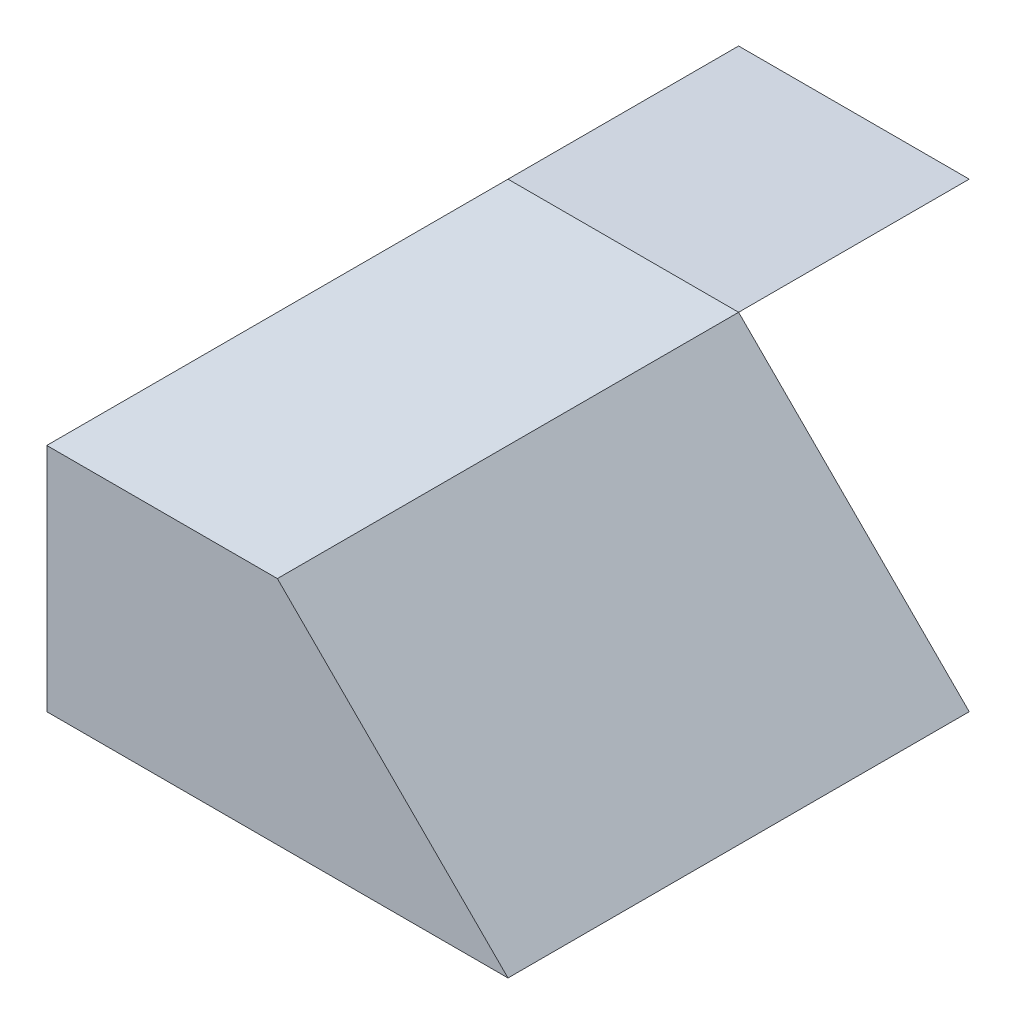
ISO-10303-21;
HEADER;
FILE_DESCRIPTION(('STEP AP214'),'2;1');
FILE_NAME('part.step','',(''),(''),'','','');
FILE_SCHEMA(('AUTOMOTIVE_DESIGN { 1 0 10303 214 1 1 1 1 }'));
ENDSEC;
DATA;
#1=APPLICATION_CONTEXT('core data for automotive mechanical design processes');
#2=APPLICATION_PROTOCOL_DEFINITION('international standard','automotive_design',2000,#1);
#3=PRODUCT_CONTEXT('',#1,'mechanical');
#4=PRODUCT('Part','Part','',(#3));
#5=PRODUCT_RELATED_PRODUCT_CATEGORY('part','',(#4));
#6=PRODUCT_DEFINITION_FORMATION('','',#4);
#7=PRODUCT_DEFINITION_CONTEXT('part definition',#1,'design');
#8=PRODUCT_DEFINITION('design','',#6,#7);
#9=PRODUCT_DEFINITION_SHAPE('','',#8);
#10=(LENGTH_UNIT() NAMED_UNIT(*) SI_UNIT(.MILLI.,.METRE.));
#11=(NAMED_UNIT(*) PLANE_ANGLE_UNIT() SI_UNIT($,.RADIAN.));
#12=(NAMED_UNIT(*) SI_UNIT($,.STERADIAN.) SOLID_ANGLE_UNIT());
#13=UNCERTAINTY_MEASURE_WITH_UNIT(LENGTH_MEASURE(1.E-05),#10,'distance_accuracy_value','');
#14=(GEOMETRIC_REPRESENTATION_CONTEXT(3) GLOBAL_UNCERTAINTY_ASSIGNED_CONTEXT((#13)) GLOBAL_UNIT_ASSIGNED_CONTEXT((#10,
#11,#12)) REPRESENTATION_CONTEXT('',''));
#15=CARTESIAN_POINT('',(0.,0.,0.));
#16=DIRECTION('',(0.,0.,1.));
#17=DIRECTION('',(1.,0.,0.));
#18=AXIS2_PLACEMENT_3D('',#15,#16,#17);
#19=CARTESIAN_POINT('',(-2.,4.,-2.));
#20=DIRECTION('',(0.,0.,1.));
#21=DIRECTION('',(1.,0.,0.));
#22=AXIS2_PLACEMENT_3D('',#19,#20,#21);
#23=PLANE('',#22);
#24=DIRECTION('',(-1.,0.,0.));
#25=VECTOR('',#24,1.);
#26=CARTESIAN_POINT('',(-2.,4.,-2.));
#27=LINE('',#26,#25);
#28=CARTESIAN_POINT('',(2.,4.,-2.));
#29=VERTEX_POINT('',#28);
#30=CARTESIAN_POINT('',(0.,4.,-2.));
#31=VERTEX_POINT('',#30);
#32=EDGE_CURVE('E132',#29,#31,#27,.T.);
#33=ORIENTED_EDGE('',*,*,#32,.F.);
#34=DIRECTION('',(-0.707106781186548,-0.707106781186548,0.));
#35=VECTOR('',#34,1.);
#36=CARTESIAN_POINT('',(-1.,1.,-2.));
#37=LINE('',#36,#35);
#38=CARTESIAN_POINT('',(0.,2.,-2.));
#39=VERTEX_POINT('',#38);
#40=EDGE_CURVE('E113',#29,#39,#37,.T.);
#41=ORIENTED_EDGE('',*,*,#40,.T.);
#42=DIRECTION('',(0.707106781186548,-0.707106781186548,0.));
#43=VECTOR('',#42,1.);
#44=CARTESIAN_POINT('',(1.,1.,-2.));
#45=LINE('',#44,#43);
#46=CARTESIAN_POINT('',(2.,0.,-2.));
#47=VERTEX_POINT('',#46);
#48=EDGE_CURVE('E163',#39,#47,#45,.T.);
#49=ORIENTED_EDGE('',*,*,#48,.T.);
#50=DIRECTION('',(-1.,0.,0.));
#51=VECTOR('',#50,1.);
#52=CARTESIAN_POINT('',(-2.,0.,-2.));
#53=LINE('',#52,#51);
#54=CARTESIAN_POINT('',(-2.,0.,-2.));
#55=VERTEX_POINT('',#54);
#56=EDGE_CURVE('E125',#47,#55,#53,.T.);
#57=ORIENTED_EDGE('',*,*,#56,.T.);
#58=DIRECTION('',(0.,-1.,0.));
#59=VECTOR('',#58,1.);
#60=CARTESIAN_POINT('',(-2.,4.,-2.));
#61=LINE('',#60,#59);
#62=CARTESIAN_POINT('',(-2.,2.,-2.));
#63=VERTEX_POINT('',#62);
#64=EDGE_CURVE('E137',#63,#55,#61,.T.);
#65=ORIENTED_EDGE('',*,*,#64,.F.);
#66=DIRECTION('',(-0.707106781186548,-0.707106781186548,0.));
#67=VECTOR('',#66,1.);
#68=CARTESIAN_POINT('',(-2.,2.,-2.));
#69=LINE('',#68,#67);
#70=EDGE_CURVE('E112',#31,#63,#69,.T.);
#71=ORIENTED_EDGE('',*,*,#70,.F.);
#72=EDGE_LOOP('',(#33,#41,#49,#57,#65,#71));
#73=FACE_BOUND('',#72,.T.);
#74=ADVANCED_FACE('F51',(#73),#23,.F.);
#75=CARTESIAN_POINT('',(-2.,4.,2.));
#76=DIRECTION('',(1.,0.,0.));
#77=DIRECTION('',(0.,0.,-1.));
#78=AXIS2_PLACEMENT_3D('',#75,#76,#77);
#79=PLANE('',#78);
#80=DIRECTION('',(0.,0.,1.));
#81=VECTOR('',#80,1.);
#82=CARTESIAN_POINT('',(-2.,2.,-2.));
#83=LINE('',#82,#81);
#84=CARTESIAN_POINT('',(-2.,2.,2.));
#85=VERTEX_POINT('',#84);
#86=EDGE_CURVE('E145',#63,#85,#83,.T.);
#87=ORIENTED_EDGE('',*,*,#86,.F.);
#88=ORIENTED_EDGE('',*,*,#64,.T.);
#89=DIRECTION('',(0.,0.,1.));
#90=VECTOR('',#89,1.);
#91=CARTESIAN_POINT('',(-2.,0.,2.));
#92=LINE('',#91,#90);
#93=CARTESIAN_POINT('',(-2.,0.,2.));
#94=VERTEX_POINT('',#93);
#95=EDGE_CURVE('E120',#55,#94,#92,.T.);
#96=ORIENTED_EDGE('',*,*,#95,.T.);
#97=DIRECTION('',(0.,-1.,0.));
#98=VECTOR('',#97,1.);
#99=CARTESIAN_POINT('',(-2.,4.,2.));
#100=LINE('',#99,#98);
#101=EDGE_CURVE('E72',#85,#94,#100,.T.);
#102=ORIENTED_EDGE('',*,*,#101,.F.);
#103=EDGE_LOOP('',(#87,#88,#96,#102));
#104=FACE_BOUND('',#103,.T.);
#105=ADVANCED_FACE('F166',(#104),#79,.F.);
#106=CARTESIAN_POINT('',(0.,4.,0.));
#107=DIRECTION('',(0.,-1.,0.));
#108=DIRECTION('',(0.,0.,-1.));
#109=AXIS2_PLACEMENT_3D('',#106,#107,#108);
#110=PLANE('',#109);
#111=DIRECTION('',(0.,0.,1.));
#112=VECTOR('',#111,1.);
#113=CARTESIAN_POINT('',(0.,4.,-2.));
#114=LINE('',#113,#112);
#115=CARTESIAN_POINT('',(0.,4.,0.));
#116=VERTEX_POINT('',#115);
#117=EDGE_CURVE('E142',#31,#116,#114,.T.);
#118=ORIENTED_EDGE('',*,*,#117,.T.);
#119=DIRECTION('',(-1.,0.,0.));
#120=VECTOR('',#119,1.);
#121=CARTESIAN_POINT('',(2.,4.,0.));
#122=LINE('',#121,#120);
#123=CARTESIAN_POINT('',(2.,4.,0.));
#124=VERTEX_POINT('',#123);
#125=EDGE_CURVE('E129',#124,#116,#122,.T.);
#126=ORIENTED_EDGE('',*,*,#125,.F.);
#127=DIRECTION('',(0.,0.,-1.));
#128=VECTOR('',#127,1.);
#129=CARTESIAN_POINT('',(2.,4.,2.));
#130=LINE('',#129,#128);
#131=EDGE_CURVE('E65',#124,#29,#130,.T.);
#132=ORIENTED_EDGE('',*,*,#131,.T.);
#133=ORIENTED_EDGE('',*,*,#32,.T.);
#134=EDGE_LOOP('',(#118,#126,#132,#133));
#135=FACE_BOUND('',#134,.T.);
#136=ADVANCED_FACE('F151',(#135),#110,.F.);
#137=CARTESIAN_POINT('',(2.,4.,0.));
#138=DIRECTION('',(0.,-0.707106781186547,-0.707106781186547));
#139=DIRECTION('',(0.,0.707106781186548,-0.707106781186548));
#140=AXIS2_PLACEMENT_3D('',#137,#138,#139);
#141=PLANE('',#140);
#142=DIRECTION('',(-1.,0.,0.));
#143=VECTOR('',#142,1.);
#144=CARTESIAN_POINT('',(2.,2.,2.));
#145=LINE('',#144,#143);
#146=CARTESIAN_POINT('',(0.,2.,2.));
#147=VERTEX_POINT('',#146);
#148=EDGE_CURVE('E126',#147,#85,#145,.T.);
#149=ORIENTED_EDGE('',*,*,#148,.F.);
#150=DIRECTION('',(0.577350269189626,0.577350269189626,-0.577350269189626));
#151=VECTOR('',#150,1.);
#152=CARTESIAN_POINT('',(2.,4.,0.));
#153=LINE('',#152,#151);
#154=EDGE_CURVE('E12',#147,#124,#153,.T.);
#155=ORIENTED_EDGE('',*,*,#154,.T.);
#156=ORIENTED_EDGE('',*,*,#125,.T.);
#157=DIRECTION('',(0.577350269189626,0.577350269189626,-0.577350269189626));
#158=VECTOR('',#157,1.);
#159=CARTESIAN_POINT('',(0.666666666666667,4.66666666666667,-0.666666666666667));
#160=LINE('',#159,#158);
#161=EDGE_CURVE('E58',#85,#116,#160,.T.);
#162=ORIENTED_EDGE('',*,*,#161,.F.);
#163=EDGE_LOOP('',(#149,#155,#156,#162));
#164=FACE_BOUND('',#163,.T.);
#165=ADVANCED_FACE('F154',(#164),#141,.F.);
#166=CARTESIAN_POINT('',(-2.,4.,2.));
#167=DIRECTION('',(0.,0.,-1.));
#168=DIRECTION('',(-1.,0.,0.));
#169=AXIS2_PLACEMENT_3D('',#166,#167,#168);
#170=PLANE('',#169);
#171=DIRECTION('',(1.,0.,0.));
#172=VECTOR('',#171,1.);
#173=CARTESIAN_POINT('',(-2.,0.,2.));
#174=LINE('',#173,#172);
#175=CARTESIAN_POINT('',(2.,0.,2.));
#176=VERTEX_POINT('',#175);
#177=EDGE_CURVE('E116',#94,#176,#174,.T.);
#178=ORIENTED_EDGE('',*,*,#177,.T.);
#179=DIRECTION('',(0.707106781186548,-0.707106781186548,0.));
#180=VECTOR('',#179,1.);
#181=CARTESIAN_POINT('',(1.,1.,2.));
#182=LINE('',#181,#180);
#183=EDGE_CURVE('E104',#147,#176,#182,.T.);
#184=ORIENTED_EDGE('',*,*,#183,.F.);
#185=ORIENTED_EDGE('',*,*,#148,.T.);
#186=ORIENTED_EDGE('',*,*,#101,.T.);
#187=EDGE_LOOP('',(#178,#184,#185,#186));
#188=FACE_BOUND('',#187,.T.);
#189=ADVANCED_FACE('F117',(#188),#170,.F.);
#190=CARTESIAN_POINT('',(0.,0.,0.));
#191=DIRECTION('',(0.,-1.,0.));
#192=DIRECTION('',(0.,0.,-1.));
#193=AXIS2_PLACEMENT_3D('',#190,#191,#192);
#194=PLANE('',#193);
#195=DIRECTION('',(0.,0.,-1.));
#196=VECTOR('',#195,1.);
#197=CARTESIAN_POINT('',(2.,0.,2.));
#198=LINE('',#197,#196);
#199=EDGE_CURVE('E108',#176,#47,#198,.T.);
#200=ORIENTED_EDGE('',*,*,#199,.F.);
#201=ORIENTED_EDGE('',*,*,#177,.F.);
#202=ORIENTED_EDGE('',*,*,#95,.F.);
#203=ORIENTED_EDGE('',*,*,#56,.F.);
#204=EDGE_LOOP('',(#200,#201,#202,#203));
#205=FACE_BOUND('',#204,.T.);
#206=ADVANCED_FACE('F123',(#205),#194,.T.);
#207=CARTESIAN_POINT('',(-2.,2.,-2.));
#208=DIRECTION('',(-0.707106781186547,0.707106781186547,0.));
#209=DIRECTION('',(-0.707106781186548,-0.707106781186548,0.));
#210=AXIS2_PLACEMENT_3D('',#207,#208,#209);
#211=PLANE('',#210);
#212=ORIENTED_EDGE('',*,*,#161,.T.);
#213=ORIENTED_EDGE('',*,*,#117,.F.);
#214=ORIENTED_EDGE('',*,*,#70,.T.);
#215=ORIENTED_EDGE('',*,*,#86,.T.);
#216=EDGE_LOOP('',(#212,#213,#214,#215));
#217=FACE_BOUND('',#216,.T.);
#218=ADVANCED_FACE('F141',(#217),#211,.T.);
#219=CARTESIAN_POINT('',(-1.,1.,-2.));
#220=DIRECTION('',(-0.707106781186547,0.707106781186547,0.));
#221=DIRECTION('',(-0.707106781186548,-0.707106781186548,0.));
#222=AXIS2_PLACEMENT_3D('',#219,#220,#221);
#223=PLANE('',#222);
#224=DIRECTION('',(0.,0.,1.));
#225=VECTOR('',#224,1.);
#226=CARTESIAN_POINT('',(0.,2.,-2.));
#227=LINE('',#226,#225);
#228=EDGE_CURVE('E110',#39,#147,#227,.T.);
#229=ORIENTED_EDGE('',*,*,#228,.F.);
#230=ORIENTED_EDGE('',*,*,#40,.F.);
#231=ORIENTED_EDGE('',*,*,#131,.F.);
#232=ORIENTED_EDGE('',*,*,#154,.F.);
#233=EDGE_LOOP('',(#229,#230,#231,#232));
#234=FACE_BOUND('',#233,.T.);
#235=ADVANCED_FACE('F182',(#234),#223,.F.);
#236=CARTESIAN_POINT('',(1.,1.,-2.));
#237=DIRECTION('',(-0.707106781186547,-0.707106781186547,0.));
#238=DIRECTION('',(0.707106781186548,-0.707106781186548,0.));
#239=AXIS2_PLACEMENT_3D('',#236,#237,#238);
#240=PLANE('',#239);
#241=ORIENTED_EDGE('',*,*,#183,.T.);
#242=ORIENTED_EDGE('',*,*,#199,.T.);
#243=ORIENTED_EDGE('',*,*,#48,.F.);
#244=ORIENTED_EDGE('',*,*,#228,.T.);
#245=EDGE_LOOP('',(#241,#242,#243,#244));
#246=FACE_BOUND('',#245,.T.);
#247=ADVANCED_FACE('F105',(#246),#240,.F.);
#248=CLOSED_SHELL('',(#74,#105,#136,#165,#189,#206,#218,#235,#247));
#249=MANIFOLD_SOLID_BREP('B2',#248);
#250=ADVANCED_BREP_SHAPE_REPRESENTATION('',(#18,#249),#14);
#251=SHAPE_DEFINITION_REPRESENTATION(#9,#250);
ENDSEC;
END-ISO-10303-21;
